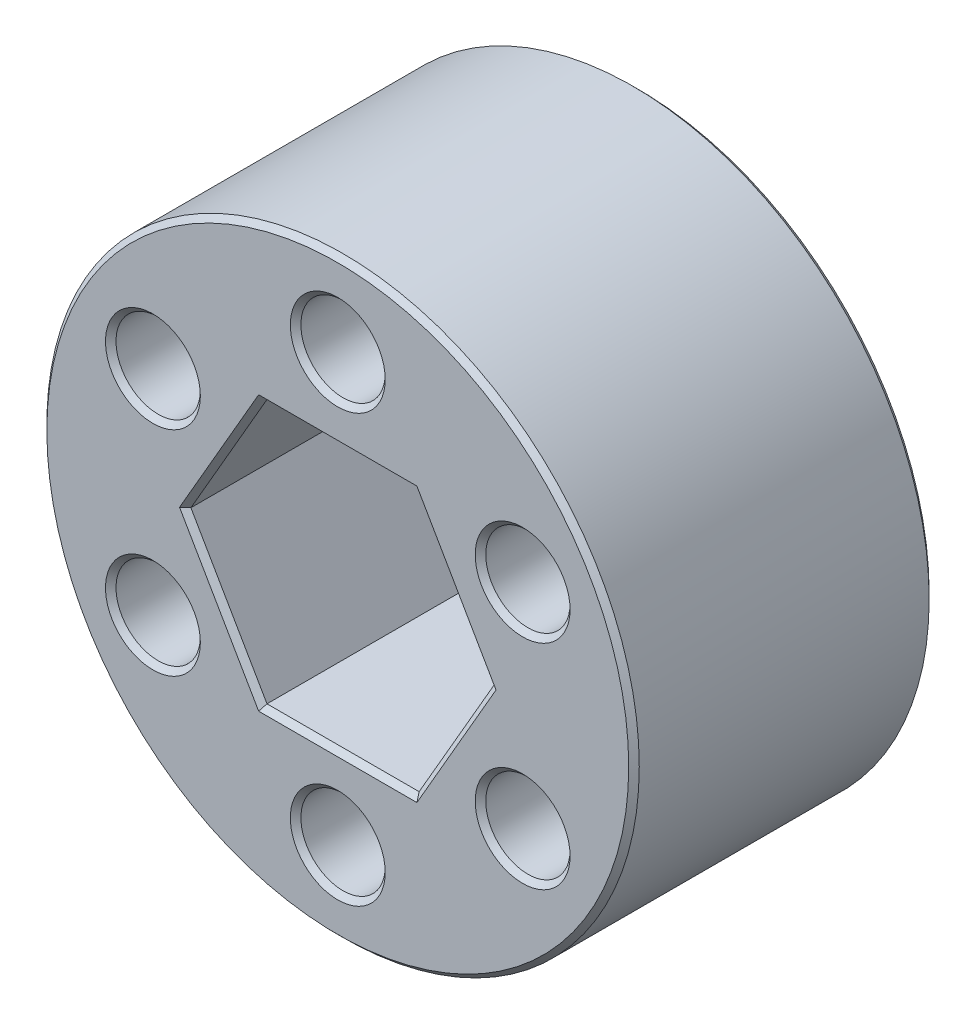
ISO-10303-21;
HEADER;
FILE_DESCRIPTION(('STEP AP214'),'2;1');
FILE_NAME('part.step','',(''),(''),'','','');
FILE_SCHEMA(('AUTOMOTIVE_DESIGN { 1 0 10303 214 1 1 1 1 }'));
ENDSEC;
DATA;
#1=APPLICATION_CONTEXT('core data for automotive mechanical design processes');
#2=APPLICATION_PROTOCOL_DEFINITION('international standard','automotive_design',2000,#1);
#3=PRODUCT_CONTEXT('',#1,'mechanical');
#4=PRODUCT('Part','Part','',(#3));
#5=PRODUCT_RELATED_PRODUCT_CATEGORY('part','',(#4));
#6=PRODUCT_DEFINITION_FORMATION('','',#4);
#7=PRODUCT_DEFINITION_CONTEXT('part definition',#1,'design');
#8=PRODUCT_DEFINITION('design','',#6,#7);
#9=PRODUCT_DEFINITION_SHAPE('','',#8);
#10=(LENGTH_UNIT() NAMED_UNIT(*) SI_UNIT(.MILLI.,.METRE.));
#11=(NAMED_UNIT(*) PLANE_ANGLE_UNIT() SI_UNIT($,.RADIAN.));
#12=(NAMED_UNIT(*) SI_UNIT($,.STERADIAN.) SOLID_ANGLE_UNIT());
#13=UNCERTAINTY_MEASURE_WITH_UNIT(LENGTH_MEASURE(1.E-05),#10,'distance_accuracy_value','');
#14=(GEOMETRIC_REPRESENTATION_CONTEXT(3) GLOBAL_UNCERTAINTY_ASSIGNED_CONTEXT((#13)) GLOBAL_UNIT_ASSIGNED_CONTEXT((#10,
#11,#12)) REPRESENTATION_CONTEXT('',''));
#15=CARTESIAN_POINT('',(0.,0.,0.));
#16=DIRECTION('',(0.,0.,1.));
#17=DIRECTION('',(1.,0.,0.));
#18=AXIS2_PLACEMENT_3D('',#15,#16,#17);
#19=CARTESIAN_POINT('',(0.,0.,14.478));
#20=DIRECTION('',(0.,0.,1.));
#21=DIRECTION('',(1.,0.,0.));
#22=AXIS2_PLACEMENT_3D('',#19,#20,#21);
#23=PLANE('',#22);
#24=CARTESIAN_POINT('',(-8.90880332873053,5.14349999999999,14.478));
#25=DIRECTION('',(0.,0.,1.));
#26=DIRECTION('',(1.,0.,0.));
#27=AXIS2_PLACEMENT_3D('',#24,#25,#26);
#28=CIRCLE('',#27,2.286);
#29=CARTESIAN_POINT('',(-6.62280332873052,5.14349999999999,14.478));
#30=VERTEX_POINT('',#29);
#31=EDGE_CURVE('E11',#30,#30,#28,.F.);
#32=ORIENTED_EDGE('',*,*,#31,.T.);
#33=EDGE_LOOP('',(#32));
#34=FACE_BOUND('',#33,.T.);
#35=CARTESIAN_POINT('',(0.,-10.287,14.478));
#36=DIRECTION('',(0.,0.,1.));
#37=DIRECTION('',(1.,0.,0.));
#38=AXIS2_PLACEMENT_3D('',#35,#36,#37);
#39=CIRCLE('',#38,2.286);
#40=CARTESIAN_POINT('',(2.286,-10.287,14.478));
#41=VERTEX_POINT('',#40);
#42=EDGE_CURVE('E42',#41,#41,#39,.F.);
#43=ORIENTED_EDGE('',*,*,#42,.T.);
#44=EDGE_LOOP('',(#43));
#45=FACE_BOUND('',#44,.T.);
#46=CARTESIAN_POINT('',(8.90880332873052,5.1435,14.478));
#47=DIRECTION('',(0.,0.,1.));
#48=DIRECTION('',(1.,0.,0.));
#49=AXIS2_PLACEMENT_3D('',#46,#47,#48);
#50=CIRCLE('',#49,2.286);
#51=CARTESIAN_POINT('',(11.1948033287305,5.1435,14.478));
#52=VERTEX_POINT('',#51);
#53=EDGE_CURVE('E262',#52,#52,#50,.F.);
#54=ORIENTED_EDGE('',*,*,#53,.T.);
#55=EDGE_LOOP('',(#54));
#56=FACE_BOUND('',#55,.T.);
#57=DIRECTION('',(-0.5,-0.866025403784439,0.));
#58=VECTOR('',#57,1.);
#59=CARTESIAN_POINT('',(5.71923176659244,-3.302,14.478));
#60=LINE('',#59,#58);
#61=CARTESIAN_POINT('',(7.62564235545659,0.,14.478));
#62=VERTEX_POINT('',#61);
#63=CARTESIAN_POINT('',(3.8128211777283,-6.60400000000001,14.478));
#64=VERTEX_POINT('',#63);
#65=EDGE_CURVE('E50',#62,#64,#60,.T.);
#66=ORIENTED_EDGE('',*,*,#65,.T.);
#67=DIRECTION('',(-1.,0.,0.));
#68=VECTOR('',#67,1.);
#69=CARTESIAN_POINT('',(0.,-6.60400000000001,14.478));
#70=LINE('',#69,#68);
#71=CARTESIAN_POINT('',(-3.81282117772829,-6.60400000000001,14.478));
#72=VERTEX_POINT('',#71);
#73=EDGE_CURVE('E260',#64,#72,#70,.T.);
#74=ORIENTED_EDGE('',*,*,#73,.T.);
#75=DIRECTION('',(-0.5,0.866025403784439,0.));
#76=VECTOR('',#75,1.);
#77=CARTESIAN_POINT('',(-5.71923176659244,-3.30200000000001,14.478));
#78=LINE('',#77,#76);
#79=CARTESIAN_POINT('',(-7.62564235545659,0.,14.478));
#80=VERTEX_POINT('',#79);
#81=EDGE_CURVE('E252',#72,#80,#78,.T.);
#82=ORIENTED_EDGE('',*,*,#81,.T.);
#83=DIRECTION('',(0.5,0.866025403784439,0.));
#84=VECTOR('',#83,1.);
#85=CARTESIAN_POINT('',(-5.71923176659244,3.302,14.478));
#86=LINE('',#85,#84);
#87=CARTESIAN_POINT('',(-3.81282117772829,6.60400000000001,14.478));
#88=VERTEX_POINT('',#87);
#89=EDGE_CURVE('E254',#80,#88,#86,.T.);
#90=ORIENTED_EDGE('',*,*,#89,.T.);
#91=DIRECTION('',(1.,0.,0.));
#92=VECTOR('',#91,1.);
#93=CARTESIAN_POINT('',(0.,6.60400000000001,14.478));
#94=LINE('',#93,#92);
#95=CARTESIAN_POINT('',(3.81282117772829,6.60400000000001,14.478));
#96=VERTEX_POINT('',#95);
#97=EDGE_CURVE('E256',#88,#96,#94,.T.);
#98=ORIENTED_EDGE('',*,*,#97,.T.);
#99=DIRECTION('',(0.5,-0.866025403784439,0.));
#100=VECTOR('',#99,1.);
#101=CARTESIAN_POINT('',(5.71923176659244,3.30200000000001,14.478));
#102=LINE('',#101,#100);
#103=EDGE_CURVE('E55',#96,#62,#102,.T.);
#104=ORIENTED_EDGE('',*,*,#103,.T.);
#105=EDGE_LOOP('',(#66,#74,#82,#90,#98,#104));
#106=FACE_BOUND('',#105,.T.);
#107=CARTESIAN_POINT('',(0.,0.,14.478));
#108=DIRECTION('',(0.,0.,1.));
#109=DIRECTION('',(1.,0.,0.));
#110=AXIS2_PLACEMENT_3D('',#107,#108,#109);
#111=CIRCLE('',#110,14.0208);
#112=CARTESIAN_POINT('',(14.0208,0.,14.478));
#113=VERTEX_POINT('',#112);
#114=EDGE_CURVE('E249',#113,#113,#111,.T.);
#115=ORIENTED_EDGE('',*,*,#114,.T.);
#116=EDGE_LOOP('',(#115));
#117=FACE_BOUND('',#116,.T.);
#118=CARTESIAN_POINT('',(0.,10.287,14.478));
#119=DIRECTION('',(0.,0.,1.));
#120=DIRECTION('',(1.,0.,0.));
#121=AXIS2_PLACEMENT_3D('',#118,#119,#120);
#122=CIRCLE('',#121,2.286);
#123=CARTESIAN_POINT('',(2.286,10.287,14.478));
#124=VERTEX_POINT('',#123);
#125=EDGE_CURVE('E246',#124,#124,#122,.F.);
#126=ORIENTED_EDGE('',*,*,#125,.T.);
#127=EDGE_LOOP('',(#126));
#128=FACE_BOUND('',#127,.T.);
#129=CARTESIAN_POINT('',(8.90880332873052,-5.1435,14.478));
#130=DIRECTION('',(0.,0.,1.));
#131=DIRECTION('',(1.,0.,0.));
#132=AXIS2_PLACEMENT_3D('',#129,#130,#131);
#133=CIRCLE('',#132,2.286);
#134=CARTESIAN_POINT('',(11.1948033287305,-5.1435,14.478));
#135=VERTEX_POINT('',#134);
#136=EDGE_CURVE('E243',#135,#135,#133,.F.);
#137=ORIENTED_EDGE('',*,*,#136,.T.);
#138=EDGE_LOOP('',(#137));
#139=FACE_BOUND('',#138,.T.);
#140=CARTESIAN_POINT('',(-8.90880332873052,-5.14350000000001,14.478));
#141=DIRECTION('',(0.,0.,1.));
#142=DIRECTION('',(1.,0.,0.));
#143=AXIS2_PLACEMENT_3D('',#140,#141,#142);
#144=CIRCLE('',#143,2.286);
#145=CARTESIAN_POINT('',(-6.62280332873052,-5.14350000000001,14.478));
#146=VERTEX_POINT('',#145);
#147=EDGE_CURVE('E240',#146,#146,#144,.F.);
#148=ORIENTED_EDGE('',*,*,#147,.T.);
#149=EDGE_LOOP('',(#148));
#150=FACE_BOUND('',#149,.T.);
#151=ADVANCED_FACE('F33',(#34,#45,#56,#106,#117,#128,#139,#150),#23,.T.);
#152=CARTESIAN_POINT('',(0.,0.,0.));
#153=DIRECTION('',(0.,0.,1.));
#154=DIRECTION('',(1.,0.,0.));
#155=AXIS2_PLACEMENT_3D('',#152,#153,#154);
#156=PLANE('',#155);
#157=CARTESIAN_POINT('',(-8.90880332873053,5.14349999999999,0.));
#158=DIRECTION('',(0.,0.,1.));
#159=DIRECTION('',(1.,0.,0.));
#160=AXIS2_PLACEMENT_3D('',#157,#158,#159);
#161=CIRCLE('',#160,2.286);
#162=CARTESIAN_POINT('',(-6.62280332873053,5.14349999999999,0.));
#163=VERTEX_POINT('',#162);
#164=EDGE_CURVE('E171',#163,#163,#161,.T.);
#165=ORIENTED_EDGE('',*,*,#164,.T.);
#166=EDGE_LOOP('',(#165));
#167=FACE_BOUND('',#166,.T.);
#168=CARTESIAN_POINT('',(-8.90880332873052,-5.14350000000001,0.));
#169=DIRECTION('',(0.,0.,1.));
#170=DIRECTION('',(1.,0.,0.));
#171=AXIS2_PLACEMENT_3D('',#168,#169,#170);
#172=CIRCLE('',#171,2.286);
#173=CARTESIAN_POINT('',(-6.62280332873052,-5.14350000000001,0.));
#174=VERTEX_POINT('',#173);
#175=EDGE_CURVE('E168',#174,#174,#172,.T.);
#176=ORIENTED_EDGE('',*,*,#175,.T.);
#177=EDGE_LOOP('',(#176));
#178=FACE_BOUND('',#177,.T.);
#179=CARTESIAN_POINT('',(0.,-10.287,0.));
#180=DIRECTION('',(0.,0.,1.));
#181=DIRECTION('',(1.,0.,0.));
#182=AXIS2_PLACEMENT_3D('',#179,#180,#181);
#183=CIRCLE('',#182,2.286);
#184=CARTESIAN_POINT('',(2.286,-10.287,0.));
#185=VERTEX_POINT('',#184);
#186=EDGE_CURVE('E165',#185,#185,#183,.T.);
#187=ORIENTED_EDGE('',*,*,#186,.T.);
#188=EDGE_LOOP('',(#187));
#189=FACE_BOUND('',#188,.T.);
#190=CARTESIAN_POINT('',(8.90880332873052,-5.1435,0.));
#191=DIRECTION('',(0.,0.,1.));
#192=DIRECTION('',(1.,0.,0.));
#193=AXIS2_PLACEMENT_3D('',#190,#191,#192);
#194=CIRCLE('',#193,2.286);
#195=CARTESIAN_POINT('',(11.1948033287305,-5.1435,0.));
#196=VERTEX_POINT('',#195);
#197=EDGE_CURVE('E162',#196,#196,#194,.T.);
#198=ORIENTED_EDGE('',*,*,#197,.T.);
#199=EDGE_LOOP('',(#198));
#200=FACE_BOUND('',#199,.T.);
#201=CARTESIAN_POINT('',(8.90880332873052,5.1435,0.));
#202=DIRECTION('',(0.,0.,1.));
#203=DIRECTION('',(1.,0.,0.));
#204=AXIS2_PLACEMENT_3D('',#201,#202,#203);
#205=CIRCLE('',#204,2.286);
#206=CARTESIAN_POINT('',(11.1948033287305,5.1435,0.));
#207=VERTEX_POINT('',#206);
#208=EDGE_CURVE('E154',#207,#207,#205,.T.);
#209=ORIENTED_EDGE('',*,*,#208,.T.);
#210=EDGE_LOOP('',(#209));
#211=FACE_BOUND('',#210,.T.);
#212=CARTESIAN_POINT('',(0.,10.287,0.));
#213=DIRECTION('',(0.,0.,1.));
#214=DIRECTION('',(1.,0.,0.));
#215=AXIS2_PLACEMENT_3D('',#212,#213,#214);
#216=CIRCLE('',#215,2.286);
#217=CARTESIAN_POINT('',(2.286,10.287,0.));
#218=VERTEX_POINT('',#217);
#219=EDGE_CURVE('E151',#218,#218,#216,.T.);
#220=ORIENTED_EDGE('',*,*,#219,.T.);
#221=EDGE_LOOP('',(#220));
#222=FACE_BOUND('',#221,.T.);
#223=DIRECTION('',(-0.5,0.866025403784439,0.));
#224=VECTOR('',#223,1.);
#225=CARTESIAN_POINT('',(3.88614466191536,6.477,0.));
#226=LINE('',#225,#224);
#227=CARTESIAN_POINT('',(7.62564235545657,0.,0.));
#228=VERTEX_POINT('',#227);
#229=CARTESIAN_POINT('',(3.81282117772828,6.60399999999999,0.));
#230=VERTEX_POINT('',#229);
#231=EDGE_CURVE('E149',#228,#230,#226,.T.);
#232=ORIENTED_EDGE('',*,*,#231,.T.);
#233=DIRECTION('',(-1.,0.,0.));
#234=VECTOR('',#233,1.);
#235=CARTESIAN_POINT('',(-3.66617420935412,6.60399999999999,0.));
#236=LINE('',#235,#234);
#237=CARTESIAN_POINT('',(-3.81282117772828,6.60399999999999,0.));
#238=VERTEX_POINT('',#237);
#239=EDGE_CURVE('E129',#230,#238,#236,.T.);
#240=ORIENTED_EDGE('',*,*,#239,.T.);
#241=DIRECTION('',(-0.5,-0.866025403784439,0.));
#242=VECTOR('',#241,1.);
#243=CARTESIAN_POINT('',(-7.55231887126949,0.126999999999992,0.));
#244=LINE('',#243,#242);
#245=CARTESIAN_POINT('',(-7.62564235545657,0.,0.));
#246=VERTEX_POINT('',#245);
#247=EDGE_CURVE('E137',#238,#246,#244,.T.);
#248=ORIENTED_EDGE('',*,*,#247,.T.);
#249=DIRECTION('',(0.5,-0.866025403784439,0.));
#250=VECTOR('',#249,1.);
#251=CARTESIAN_POINT('',(-3.88614466191536,-6.477,0.));
#252=LINE('',#251,#250);
#253=CARTESIAN_POINT('',(-3.81282117772828,-6.60399999999999,0.));
#254=VERTEX_POINT('',#253);
#255=EDGE_CURVE('E143',#246,#254,#252,.T.);
#256=ORIENTED_EDGE('',*,*,#255,.T.);
#257=DIRECTION('',(1.,0.,0.));
#258=VECTOR('',#257,1.);
#259=CARTESIAN_POINT('',(3.66617420935413,-6.60399999999999,0.));
#260=LINE('',#259,#258);
#261=CARTESIAN_POINT('',(3.81282117772829,-6.60399999999999,0.));
#262=VERTEX_POINT('',#261);
#263=EDGE_CURVE('E335',#254,#262,#260,.T.);
#264=ORIENTED_EDGE('',*,*,#263,.T.);
#265=DIRECTION('',(0.5,0.866025403784439,0.));
#266=VECTOR('',#265,1.);
#267=CARTESIAN_POINT('',(7.55231887126949,-0.126999999999993,0.));
#268=LINE('',#267,#266);
#269=EDGE_CURVE('E156',#262,#228,#268,.T.);
#270=ORIENTED_EDGE('',*,*,#269,.T.);
#271=EDGE_LOOP('',(#232,#240,#248,#256,#264,#270));
#272=FACE_BOUND('',#271,.T.);
#273=CARTESIAN_POINT('',(0.,0.,0.));
#274=DIRECTION('',(0.,0.,1.));
#275=DIRECTION('',(1.,0.,0.));
#276=AXIS2_PLACEMENT_3D('',#273,#274,#275);
#277=CIRCLE('',#276,14.0208);
#278=CARTESIAN_POINT('',(14.0208,0.,0.));
#279=VERTEX_POINT('',#278);
#280=EDGE_CURVE('E144',#279,#279,#277,.F.);
#281=ORIENTED_EDGE('',*,*,#280,.T.);
#282=EDGE_LOOP('',(#281));
#283=FACE_BOUND('',#282,.T.);
#284=ADVANCED_FACE('F146',(#167,#178,#189,#200,#211,#222,#272,#283),#156,.F.);
#285=CARTESIAN_POINT('',(0.,0.,14.478));
#286=DIRECTION('',(0.,0.,-1.));
#287=DIRECTION('',(-1.,0.,0.));
#288=AXIS2_PLACEMENT_3D('',#285,#286,#287);
#289=CYLINDRICAL_SURFACE('',#288,14.2748);
#290=CARTESIAN_POINT('',(0.,0.,0.253999999999999));
#291=DIRECTION('',(0.,0.,1.));
#292=DIRECTION('',(1.,0.,0.));
#293=AXIS2_PLACEMENT_3D('',#290,#291,#292);
#294=CIRCLE('',#293,14.2748);
#295=CARTESIAN_POINT('',(14.2748,0.,0.253999999999999));
#296=VERTEX_POINT('',#295);
#297=EDGE_CURVE('E237',#296,#296,#294,.T.);
#298=ORIENTED_EDGE('',*,*,#297,.T.);
#299=EDGE_LOOP('',(#298));
#300=FACE_BOUND('',#299,.T.);
#301=CARTESIAN_POINT('',(0.,0.,14.224));
#302=DIRECTION('',(0.,0.,1.));
#303=DIRECTION('',(1.,0.,0.));
#304=AXIS2_PLACEMENT_3D('',#301,#302,#303);
#305=CIRCLE('',#304,14.2748);
#306=CARTESIAN_POINT('',(14.2748,0.,14.224));
#307=VERTEX_POINT('',#306);
#308=EDGE_CURVE('E234',#307,#307,#305,.F.);
#309=ORIENTED_EDGE('',*,*,#308,.T.);
#310=EDGE_LOOP('',(#309));
#311=FACE_BOUND('',#310,.T.);
#312=ADVANCED_FACE('F386',(#300,#311),#289,.T.);
#313=CARTESIAN_POINT('',(-3.66617420935412,6.35,14.478));
#314=DIRECTION('',(0.866025403784439,-0.5,0.));
#315=DIRECTION('',(0.5,0.866025403784439,0.));
#316=AXIS2_PLACEMENT_3D('',#313,#314,#315);
#317=PLANE('',#316);
#318=DIRECTION('',(0.,0.,-1.));
#319=VECTOR('',#318,1.);
#320=CARTESIAN_POINT('',(-7.33234841870825,0.,14.478));
#321=LINE('',#320,#319);
#322=CARTESIAN_POINT('',(-7.33234841870825,0.,14.224));
#323=VERTEX_POINT('',#322);
#324=CARTESIAN_POINT('',(-7.33234841870825,0.,0.25399999999999));
#325=VERTEX_POINT('',#324);
#326=EDGE_CURVE('E319',#323,#325,#321,.T.);
#327=ORIENTED_EDGE('',*,*,#326,.T.);
#328=DIRECTION('',(0.5,0.866025403784439,0.));
#329=VECTOR('',#328,1.);
#330=CARTESIAN_POINT('',(-3.66617420935412,6.35,0.25399999999999));
#331=LINE('',#330,#329);
#332=CARTESIAN_POINT('',(-3.66617420935412,6.35,0.25399999999999));
#333=VERTEX_POINT('',#332);
#334=EDGE_CURVE('E232',#325,#333,#331,.T.);
#335=ORIENTED_EDGE('',*,*,#334,.T.);
#336=DIRECTION('',(0.,0.,-1.));
#337=VECTOR('',#336,1.);
#338=CARTESIAN_POINT('',(-3.66617420935412,6.35,14.478));
#339=LINE('',#338,#337);
#340=CARTESIAN_POINT('',(-3.66617420935412,6.35,14.224));
#341=VERTEX_POINT('',#340);
#342=EDGE_CURVE('E278',#341,#333,#339,.T.);
#343=ORIENTED_EDGE('',*,*,#342,.F.);
#344=DIRECTION('',(-0.5,-0.866025403784439,0.));
#345=VECTOR('',#344,1.);
#346=CARTESIAN_POINT('',(-3.66617420935412,6.35,14.224));
#347=LINE('',#346,#345);
#348=EDGE_CURVE('E230',#341,#323,#347,.T.);
#349=ORIENTED_EDGE('',*,*,#348,.T.);
#350=EDGE_LOOP('',(#327,#335,#343,#349));
#351=FACE_BOUND('',#350,.T.);
#352=ADVANCED_FACE('F391',(#351),#317,.T.);
#353=CARTESIAN_POINT('',(-7.33234841870825,0.,14.478));
#354=DIRECTION('',(0.866025403784439,0.5,0.));
#355=DIRECTION('',(-0.5,0.866025403784439,0.));
#356=AXIS2_PLACEMENT_3D('',#353,#354,#355);
#357=PLANE('',#356);
#358=DIRECTION('',(0.,0.,-1.));
#359=VECTOR('',#358,1.);
#360=CARTESIAN_POINT('',(-3.66617420935412,-6.35,14.478));
#361=LINE('',#360,#359);
#362=CARTESIAN_POINT('',(-3.66617420935412,-6.35,14.224));
#363=VERTEX_POINT('',#362);
#364=CARTESIAN_POINT('',(-3.66617420935412,-6.35,0.25399999999999));
#365=VERTEX_POINT('',#364);
#366=EDGE_CURVE('E316',#363,#365,#361,.T.);
#367=ORIENTED_EDGE('',*,*,#366,.T.);
#368=DIRECTION('',(-0.5,0.866025403784439,0.));
#369=VECTOR('',#368,1.);
#370=CARTESIAN_POINT('',(-7.33234841870825,0.,0.25399999999999));
#371=LINE('',#370,#369);
#372=EDGE_CURVE('E228',#365,#325,#371,.T.);
#373=ORIENTED_EDGE('',*,*,#372,.T.);
#374=ORIENTED_EDGE('',*,*,#326,.F.);
#375=DIRECTION('',(0.5,-0.866025403784439,0.));
#376=VECTOR('',#375,1.);
#377=CARTESIAN_POINT('',(-7.33234841870825,0.,14.224));
#378=LINE('',#377,#376);
#379=EDGE_CURVE('E226',#323,#363,#378,.T.);
#380=ORIENTED_EDGE('',*,*,#379,.T.);
#381=EDGE_LOOP('',(#367,#373,#374,#380));
#382=FACE_BOUND('',#381,.T.);
#383=ADVANCED_FACE('F315',(#382),#357,.T.);
#384=CARTESIAN_POINT('',(-3.66617420935412,-6.35,14.478));
#385=DIRECTION('',(0.,1.,0.));
#386=DIRECTION('',(-1.,0.,0.));
#387=AXIS2_PLACEMENT_3D('',#384,#385,#386);
#388=PLANE('',#387);
#389=DIRECTION('',(0.,0.,-1.));
#390=VECTOR('',#389,1.);
#391=CARTESIAN_POINT('',(3.66617420935413,-6.35,14.478));
#392=LINE('',#391,#390);
#393=CARTESIAN_POINT('',(3.66617420935413,-6.35,14.224));
#394=VERTEX_POINT('',#393);
#395=CARTESIAN_POINT('',(3.66617420935413,-6.35,0.25399999999999));
#396=VERTEX_POINT('',#395);
#397=EDGE_CURVE('E325',#394,#396,#392,.T.);
#398=ORIENTED_EDGE('',*,*,#397,.T.);
#399=DIRECTION('',(-1.,0.,0.));
#400=VECTOR('',#399,1.);
#401=CARTESIAN_POINT('',(-3.66617420935412,-6.35,0.25399999999999));
#402=LINE('',#401,#400);
#403=EDGE_CURVE('E224',#396,#365,#402,.T.);
#404=ORIENTED_EDGE('',*,*,#403,.T.);
#405=ORIENTED_EDGE('',*,*,#366,.F.);
#406=DIRECTION('',(1.,0.,0.));
#407=VECTOR('',#406,1.);
#408=CARTESIAN_POINT('',(-3.66617420935412,-6.35,14.224));
#409=LINE('',#408,#407);
#410=EDGE_CURVE('E221',#363,#394,#409,.T.);
#411=ORIENTED_EDGE('',*,*,#410,.T.);
#412=EDGE_LOOP('',(#398,#404,#405,#411));
#413=FACE_BOUND('',#412,.T.);
#414=ADVANCED_FACE('F322',(#413),#388,.T.);
#415=CARTESIAN_POINT('',(3.66617420935413,-6.35,14.478));
#416=DIRECTION('',(-0.866025403784439,0.5,0.));
#417=DIRECTION('',(-0.5,-0.866025403784439,0.));
#418=AXIS2_PLACEMENT_3D('',#415,#416,#417);
#419=PLANE('',#418);
#420=DIRECTION('',(0.,0.,-1.));
#421=VECTOR('',#420,1.);
#422=CARTESIAN_POINT('',(7.33234841870825,0.,14.478));
#423=LINE('',#422,#421);
#424=CARTESIAN_POINT('',(7.33234841870825,0.,14.224));
#425=VERTEX_POINT('',#424);
#426=CARTESIAN_POINT('',(7.33234841870825,0.,0.25399999999999));
#427=VERTEX_POINT('',#426);
#428=EDGE_CURVE('E328',#425,#427,#423,.T.);
#429=ORIENTED_EDGE('',*,*,#428,.T.);
#430=DIRECTION('',(-0.5,-0.866025403784439,0.));
#431=VECTOR('',#430,1.);
#432=CARTESIAN_POINT('',(3.66617420935413,-6.35,0.25399999999999));
#433=LINE('',#432,#431);
#434=EDGE_CURVE('E219',#427,#396,#433,.T.);
#435=ORIENTED_EDGE('',*,*,#434,.T.);
#436=ORIENTED_EDGE('',*,*,#397,.F.);
#437=DIRECTION('',(0.5,0.866025403784439,0.));
#438=VECTOR('',#437,1.);
#439=CARTESIAN_POINT('',(3.66617420935413,-6.35,14.224));
#440=LINE('',#439,#438);
#441=EDGE_CURVE('E217',#394,#425,#440,.T.);
#442=ORIENTED_EDGE('',*,*,#441,.T.);
#443=EDGE_LOOP('',(#429,#435,#436,#442));
#444=FACE_BOUND('',#443,.T.);
#445=ADVANCED_FACE('F360',(#444),#419,.T.);
#446=CARTESIAN_POINT('',(7.33234841870825,0.,14.478));
#447=DIRECTION('',(-0.866025403784438,-0.5,0.));
#448=DIRECTION('',(0.5,-0.866025403784439,0.));
#449=AXIS2_PLACEMENT_3D('',#446,#447,#448);
#450=PLANE('',#449);
#451=DIRECTION('',(0.,0.,-1.));
#452=VECTOR('',#451,1.);
#453=CARTESIAN_POINT('',(3.66617420935412,6.35,14.478));
#454=LINE('',#453,#452);
#455=CARTESIAN_POINT('',(3.66617420935412,6.35,14.224));
#456=VERTEX_POINT('',#455);
#457=CARTESIAN_POINT('',(3.66617420935412,6.35,0.25399999999999));
#458=VERTEX_POINT('',#457);
#459=EDGE_CURVE('E354',#456,#458,#454,.T.);
#460=ORIENTED_EDGE('',*,*,#459,.T.);
#461=DIRECTION('',(0.5,-0.866025403784439,0.));
#462=VECTOR('',#461,1.);
#463=CARTESIAN_POINT('',(7.33234841870825,0.,0.253999999999991));
#464=LINE('',#463,#462);
#465=EDGE_CURVE('E215',#458,#427,#464,.T.);
#466=ORIENTED_EDGE('',*,*,#465,.T.);
#467=ORIENTED_EDGE('',*,*,#428,.F.);
#468=DIRECTION('',(-0.5,0.866025403784439,0.));
#469=VECTOR('',#468,1.);
#470=CARTESIAN_POINT('',(7.33234841870825,0.,14.224));
#471=LINE('',#470,#469);
#472=EDGE_CURVE('E213',#425,#456,#471,.T.);
#473=ORIENTED_EDGE('',*,*,#472,.T.);
#474=EDGE_LOOP('',(#460,#466,#467,#473));
#475=FACE_BOUND('',#474,.T.);
#476=ADVANCED_FACE('F356',(#475),#450,.T.);
#477=CARTESIAN_POINT('',(3.66617420935412,6.35,14.478));
#478=DIRECTION('',(0.,-1.,0.));
#479=DIRECTION('',(0.,0.,-1.));
#480=AXIS2_PLACEMENT_3D('',#477,#478,#479);
#481=PLANE('',#480);
#482=ORIENTED_EDGE('',*,*,#342,.T.);
#483=DIRECTION('',(1.,0.,0.));
#484=VECTOR('',#483,1.);
#485=CARTESIAN_POINT('',(3.66617420935412,6.35,0.25399999999999));
#486=LINE('',#485,#484);
#487=EDGE_CURVE('E131',#333,#458,#486,.T.);
#488=ORIENTED_EDGE('',*,*,#487,.T.);
#489=ORIENTED_EDGE('',*,*,#459,.F.);
#490=DIRECTION('',(-1.,0.,0.));
#491=VECTOR('',#490,1.);
#492=CARTESIAN_POINT('',(3.66617420935412,6.35,14.224));
#493=LINE('',#492,#491);
#494=EDGE_CURVE('E210',#456,#341,#493,.T.);
#495=ORIENTED_EDGE('',*,*,#494,.T.);
#496=EDGE_LOOP('',(#482,#488,#489,#495));
#497=FACE_BOUND('',#496,.T.);
#498=ADVANCED_FACE('F353',(#497),#481,.T.);
#499=CARTESIAN_POINT('',(0.,10.287,14.478));
#500=DIRECTION('',(0.,0.,-1.));
#501=DIRECTION('',(-1.,0.,0.));
#502=AXIS2_PLACEMENT_3D('',#499,#500,#501);
#503=CYLINDRICAL_SURFACE('',#502,2.032);
#504=CARTESIAN_POINT('',(0.,10.287,0.254000000000001));
#505=DIRECTION('',(0.,0.,1.));
#506=DIRECTION('',(1.,0.,0.));
#507=AXIS2_PLACEMENT_3D('',#504,#505,#506);
#508=CIRCLE('',#507,2.032);
#509=CARTESIAN_POINT('',(2.032,10.287,0.254000000000001));
#510=VERTEX_POINT('',#509);
#511=EDGE_CURVE('E207',#510,#510,#508,.F.);
#512=ORIENTED_EDGE('',*,*,#511,.T.);
#513=EDGE_LOOP('',(#512));
#514=FACE_BOUND('',#513,.T.);
#515=CARTESIAN_POINT('',(0.,10.287,14.224));
#516=DIRECTION('',(0.,0.,1.));
#517=DIRECTION('',(1.,0.,0.));
#518=AXIS2_PLACEMENT_3D('',#515,#516,#517);
#519=CIRCLE('',#518,2.032);
#520=CARTESIAN_POINT('',(2.032,10.287,14.224));
#521=VERTEX_POINT('',#520);
#522=EDGE_CURVE('E204',#521,#521,#519,.T.);
#523=ORIENTED_EDGE('',*,*,#522,.T.);
#524=EDGE_LOOP('',(#523));
#525=FACE_BOUND('',#524,.T.);
#526=ADVANCED_FACE('F463',(#514,#525),#503,.F.);
#527=CARTESIAN_POINT('',(8.90880332873052,5.1435,14.478));
#528=DIRECTION('',(0.,0.,-1.));
#529=DIRECTION('',(-1.,0.,0.));
#530=AXIS2_PLACEMENT_3D('',#527,#528,#529);
#531=CYLINDRICAL_SURFACE('',#530,2.032);
#532=CARTESIAN_POINT('',(8.90880332873052,5.1435,0.254000000000001));
#533=DIRECTION('',(0.,0.,1.));
#534=DIRECTION('',(1.,0.,0.));
#535=AXIS2_PLACEMENT_3D('',#532,#533,#534);
#536=CIRCLE('',#535,2.032);
#537=CARTESIAN_POINT('',(10.9408033287305,5.1435,0.254000000000001));
#538=VERTEX_POINT('',#537);
#539=EDGE_CURVE('E201',#538,#538,#536,.F.);
#540=ORIENTED_EDGE('',*,*,#539,.T.);
#541=EDGE_LOOP('',(#540));
#542=FACE_BOUND('',#541,.T.);
#543=CARTESIAN_POINT('',(8.90880332873052,5.1435,14.224));
#544=DIRECTION('',(0.,0.,1.));
#545=DIRECTION('',(1.,0.,0.));
#546=AXIS2_PLACEMENT_3D('',#543,#544,#545);
#547=CIRCLE('',#546,2.032);
#548=CARTESIAN_POINT('',(10.9408033287305,5.1435,14.224));
#549=VERTEX_POINT('',#548);
#550=EDGE_CURVE('E198',#549,#549,#547,.T.);
#551=ORIENTED_EDGE('',*,*,#550,.T.);
#552=EDGE_LOOP('',(#551));
#553=FACE_BOUND('',#552,.T.);
#554=ADVANCED_FACE('F460',(#542,#553),#531,.F.);
#555=CARTESIAN_POINT('',(8.90880332873052,-5.1435,14.478));
#556=DIRECTION('',(0.,0.,-1.));
#557=DIRECTION('',(-1.,0.,0.));
#558=AXIS2_PLACEMENT_3D('',#555,#556,#557);
#559=CYLINDRICAL_SURFACE('',#558,2.032);
#560=CARTESIAN_POINT('',(8.90880332873052,-5.1435,0.253999999999999));
#561=DIRECTION('',(0.,0.,1.));
#562=DIRECTION('',(1.,0.,0.));
#563=AXIS2_PLACEMENT_3D('',#560,#561,#562);
#564=CIRCLE('',#563,2.032);
#565=CARTESIAN_POINT('',(10.9408033287305,-5.1435,0.253999999999999));
#566=VERTEX_POINT('',#565);
#567=EDGE_CURVE('E195',#566,#566,#564,.F.);
#568=ORIENTED_EDGE('',*,*,#567,.T.);
#569=EDGE_LOOP('',(#568));
#570=FACE_BOUND('',#569,.T.);
#571=CARTESIAN_POINT('',(8.90880332873052,-5.1435,14.224));
#572=DIRECTION('',(0.,0.,1.));
#573=DIRECTION('',(1.,0.,0.));
#574=AXIS2_PLACEMENT_3D('',#571,#572,#573);
#575=CIRCLE('',#574,2.032);
#576=CARTESIAN_POINT('',(10.9408033287305,-5.1435,14.224));
#577=VERTEX_POINT('',#576);
#578=EDGE_CURVE('E192',#577,#577,#575,.T.);
#579=ORIENTED_EDGE('',*,*,#578,.T.);
#580=EDGE_LOOP('',(#579));
#581=FACE_BOUND('',#580,.T.);
#582=ADVANCED_FACE('F462',(#570,#581),#559,.F.);
#583=CARTESIAN_POINT('',(0.,-10.287,14.478));
#584=DIRECTION('',(0.,0.,-1.));
#585=DIRECTION('',(-1.,0.,0.));
#586=AXIS2_PLACEMENT_3D('',#583,#584,#585);
#587=CYLINDRICAL_SURFACE('',#586,2.032);
#588=CARTESIAN_POINT('',(0.,-10.287,0.253999999999999));
#589=DIRECTION('',(0.,0.,1.));
#590=DIRECTION('',(1.,0.,0.));
#591=AXIS2_PLACEMENT_3D('',#588,#589,#590);
#592=CIRCLE('',#591,2.032);
#593=CARTESIAN_POINT('',(2.032,-10.287,0.253999999999999));
#594=VERTEX_POINT('',#593);
#595=EDGE_CURVE('E189',#594,#594,#592,.F.);
#596=ORIENTED_EDGE('',*,*,#595,.T.);
#597=EDGE_LOOP('',(#596));
#598=FACE_BOUND('',#597,.T.);
#599=CARTESIAN_POINT('',(0.,-10.287,14.224));
#600=DIRECTION('',(0.,0.,1.));
#601=DIRECTION('',(1.,0.,0.));
#602=AXIS2_PLACEMENT_3D('',#599,#600,#601);
#603=CIRCLE('',#602,2.032);
#604=CARTESIAN_POINT('',(2.032,-10.287,14.224));
#605=VERTEX_POINT('',#604);
#606=EDGE_CURVE('E186',#605,#605,#603,.T.);
#607=ORIENTED_EDGE('',*,*,#606,.T.);
#608=EDGE_LOOP('',(#607));
#609=FACE_BOUND('',#608,.T.);
#610=ADVANCED_FACE('F470',(#598,#609),#587,.F.);
#611=CARTESIAN_POINT('',(-8.90880332873052,-5.14350000000001,14.478));
#612=DIRECTION('',(0.,0.,-1.));
#613=DIRECTION('',(-1.,0.,0.));
#614=AXIS2_PLACEMENT_3D('',#611,#612,#613);
#615=CYLINDRICAL_SURFACE('',#614,2.032);
#616=CARTESIAN_POINT('',(-8.90880332873052,-5.14350000000001,0.254000000000003));
#617=DIRECTION('',(0.,0.,1.));
#618=DIRECTION('',(1.,0.,0.));
#619=AXIS2_PLACEMENT_3D('',#616,#617,#618);
#620=CIRCLE('',#619,2.032);
#621=CARTESIAN_POINT('',(-6.87680332873052,-5.14350000000001,0.254000000000003));
#622=VERTEX_POINT('',#621);
#623=EDGE_CURVE('E183',#622,#622,#620,.F.);
#624=ORIENTED_EDGE('',*,*,#623,.T.);
#625=EDGE_LOOP('',(#624));
#626=FACE_BOUND('',#625,.T.);
#627=CARTESIAN_POINT('',(-8.90880332873052,-5.14350000000001,14.224));
#628=DIRECTION('',(0.,0.,1.));
#629=DIRECTION('',(1.,0.,0.));
#630=AXIS2_PLACEMENT_3D('',#627,#628,#629);
#631=CIRCLE('',#630,2.032);
#632=CARTESIAN_POINT('',(-6.87680332873052,-5.14350000000001,14.224));
#633=VERTEX_POINT('',#632);
#634=EDGE_CURVE('E180',#633,#633,#631,.T.);
#635=ORIENTED_EDGE('',*,*,#634,.T.);
#636=EDGE_LOOP('',(#635));
#637=FACE_BOUND('',#636,.T.);
#638=ADVANCED_FACE('F556',(#626,#637),#615,.F.);
#639=CARTESIAN_POINT('',(-8.90880332873053,5.14349999999999,14.478));
#640=DIRECTION('',(0.,0.,-1.));
#641=DIRECTION('',(-1.,0.,0.));
#642=AXIS2_PLACEMENT_3D('',#639,#640,#641);
#643=CYLINDRICAL_SURFACE('',#642,2.032);
#644=CARTESIAN_POINT('',(-8.90880332873053,5.14349999999999,0.254000000000003));
#645=DIRECTION('',(0.,0.,1.));
#646=DIRECTION('',(1.,0.,0.));
#647=AXIS2_PLACEMENT_3D('',#644,#645,#646);
#648=CIRCLE('',#647,2.032);
#649=CARTESIAN_POINT('',(-6.87680332873052,5.14349999999999,0.254000000000003));
#650=VERTEX_POINT('',#649);
#651=EDGE_CURVE('E177',#650,#650,#648,.F.);
#652=ORIENTED_EDGE('',*,*,#651,.T.);
#653=EDGE_LOOP('',(#652));
#654=FACE_BOUND('',#653,.T.);
#655=CARTESIAN_POINT('',(-8.90880332873053,5.14349999999999,14.224));
#656=DIRECTION('',(0.,0.,1.));
#657=DIRECTION('',(1.,0.,0.));
#658=AXIS2_PLACEMENT_3D('',#655,#656,#657);
#659=CIRCLE('',#658,2.032);
#660=CARTESIAN_POINT('',(-6.87680332873052,5.14349999999999,14.224));
#661=VERTEX_POINT('',#660);
#662=EDGE_CURVE('E174',#661,#661,#659,.T.);
#663=ORIENTED_EDGE('',*,*,#662,.T.);
#664=EDGE_LOOP('',(#663));
#665=FACE_BOUND('',#664,.T.);
#666=ADVANCED_FACE('F401',(#654,#665),#643,.F.);
#667=CARTESIAN_POINT('',(-8.90880332873053,5.14349999999999,0.));
#668=DIRECTION('',(0.,0.,-1.));
#669=DIRECTION('',(-1.,0.,0.));
#670=AXIS2_PLACEMENT_3D('',#667,#668,#669);
#671=CONICAL_SURFACE('',#670,2.286,0.785398163397442);
#672=ORIENTED_EDGE('',*,*,#651,.F.);
#673=EDGE_LOOP('',(#672));
#674=FACE_BOUND('',#673,.T.);
#675=ORIENTED_EDGE('',*,*,#164,.F.);
#676=EDGE_LOOP('',(#675));
#677=FACE_BOUND('',#676,.T.);
#678=ADVANCED_FACE('F397',(#674,#677),#671,.F.);
#679=CARTESIAN_POINT('',(-8.90880332873052,-5.14350000000001,0.));
#680=DIRECTION('',(0.,0.,-1.));
#681=DIRECTION('',(-1.,0.,0.));
#682=AXIS2_PLACEMENT_3D('',#679,#680,#681);
#683=CONICAL_SURFACE('',#682,2.286,0.785398163397442);
#684=ORIENTED_EDGE('',*,*,#623,.F.);
#685=EDGE_LOOP('',(#684));
#686=FACE_BOUND('',#685,.T.);
#687=ORIENTED_EDGE('',*,*,#175,.F.);
#688=EDGE_LOOP('',(#687));
#689=FACE_BOUND('',#688,.T.);
#690=ADVANCED_FACE('F400',(#686,#689),#683,.F.);
#691=CARTESIAN_POINT('',(0.,-10.287,0.));
#692=DIRECTION('',(0.,0.,-1.));
#693=DIRECTION('',(-1.,0.,0.));
#694=AXIS2_PLACEMENT_3D('',#691,#692,#693);
#695=CONICAL_SURFACE('',#694,2.286,0.785398163397449);
#696=ORIENTED_EDGE('',*,*,#595,.F.);
#697=EDGE_LOOP('',(#696));
#698=FACE_BOUND('',#697,.T.);
#699=ORIENTED_EDGE('',*,*,#186,.F.);
#700=EDGE_LOOP('',(#699));
#701=FACE_BOUND('',#700,.T.);
#702=ADVANCED_FACE('F405',(#698,#701),#695,.F.);
#703=CARTESIAN_POINT('',(8.90880332873052,-5.1435,0.));
#704=DIRECTION('',(0.,0.,-1.));
#705=DIRECTION('',(-1.,0.,0.));
#706=AXIS2_PLACEMENT_3D('',#703,#704,#705);
#707=CONICAL_SURFACE('',#706,2.286,0.785398163397448);
#708=ORIENTED_EDGE('',*,*,#567,.F.);
#709=EDGE_LOOP('',(#708));
#710=FACE_BOUND('',#709,.T.);
#711=ORIENTED_EDGE('',*,*,#197,.F.);
#712=EDGE_LOOP('',(#711));
#713=FACE_BOUND('',#712,.T.);
#714=ADVANCED_FACE('F409',(#710,#713),#707,.F.);
#715=CARTESIAN_POINT('',(8.90880332873052,5.1435,0.));
#716=DIRECTION('',(0.,0.,-1.));
#717=DIRECTION('',(-1.,0.,0.));
#718=AXIS2_PLACEMENT_3D('',#715,#716,#717);
#719=CONICAL_SURFACE('',#718,2.286,0.785398163397449);
#720=ORIENTED_EDGE('',*,*,#539,.F.);
#721=EDGE_LOOP('',(#720));
#722=FACE_BOUND('',#721,.T.);
#723=ORIENTED_EDGE('',*,*,#208,.F.);
#724=EDGE_LOOP('',(#723));
#725=FACE_BOUND('',#724,.T.);
#726=ADVANCED_FACE('F413',(#722,#725),#719,.F.);
#727=CARTESIAN_POINT('',(0.,10.287,0.));
#728=DIRECTION('',(0.,0.,-1.));
#729=DIRECTION('',(-1.,0.,0.));
#730=AXIS2_PLACEMENT_3D('',#727,#728,#729);
#731=CONICAL_SURFACE('',#730,2.286,0.785398163397447);
#732=ORIENTED_EDGE('',*,*,#511,.F.);
#733=EDGE_LOOP('',(#732));
#734=FACE_BOUND('',#733,.T.);
#735=ORIENTED_EDGE('',*,*,#219,.F.);
#736=EDGE_LOOP('',(#735));
#737=FACE_BOUND('',#736,.T.);
#738=ADVANCED_FACE('F417',(#734,#737),#731,.F.);
#739=CARTESIAN_POINT('',(0.,-6.60399999999999,0.));
#740=DIRECTION('',(0.,0.707106781186549,-0.707106781186546));
#741=DIRECTION('',(-1.,0.,0.));
#742=AXIS2_PLACEMENT_3D('',#739,#740,#741);
#743=PLANE('',#742);
#744=DIRECTION('',(-0.377964473009227,-0.654653670707976,-0.654653670707979));
#745=VECTOR('',#744,1.);
#746=CARTESIAN_POINT('',(-3.26813243805282,-5.66057142857142,0.943428571428573));
#747=LINE('',#746,#745);
#748=EDGE_CURVE('E272',#365,#254,#747,.T.);
#749=ORIENTED_EDGE('',*,*,#748,.F.);
#750=ORIENTED_EDGE('',*,*,#403,.F.);
#751=DIRECTION('',(0.377964473009233,-0.654653670707974,-0.654653670707977));
#752=VECTOR('',#751,1.);
#753=CARTESIAN_POINT('',(3.26813243805282,-5.66057142857144,0.943428571428556));
#754=LINE('',#753,#752);
#755=EDGE_CURVE('E275',#262,#396,#754,.F.);
#756=ORIENTED_EDGE('',*,*,#755,.F.);
#757=ORIENTED_EDGE('',*,*,#263,.F.);
#758=EDGE_LOOP('',(#749,#750,#756,#757));
#759=FACE_BOUND('',#758,.T.);
#760=ADVANCED_FACE('F421',(#759),#743,.T.);
#761=CARTESIAN_POINT('',(5.71923176659243,-3.30199999999999,0.));
#762=DIRECTION('',(-0.612372435695793,0.353553390593273,-0.707106781186549));
#763=DIRECTION('',(-0.5,-0.866025403784439,0.));
#764=AXIS2_PLACEMENT_3D('',#761,#762,#763);
#765=PLANE('',#764);
#766=ORIENTED_EDGE('',*,*,#755,.T.);
#767=ORIENTED_EDGE('',*,*,#434,.F.);
#768=DIRECTION('',(0.755928946018455,0.,-0.654653670707976));
#769=VECTOR('',#768,1.);
#770=CARTESIAN_POINT('',(6.53626487610562,0.,0.943428571428576));
#771=LINE('',#770,#769);
#772=EDGE_CURVE('E269',#228,#427,#771,.F.);
#773=ORIENTED_EDGE('',*,*,#772,.F.);
#774=ORIENTED_EDGE('',*,*,#269,.F.);
#775=EDGE_LOOP('',(#766,#767,#773,#774));
#776=FACE_BOUND('',#775,.T.);
#777=ADVANCED_FACE('F342',(#776),#765,.T.);
#778=CARTESIAN_POINT('',(-5.71923176659242,-3.302,0.));
#779=DIRECTION('',(0.612372435695796,0.353553390593274,-0.707106781186546));
#780=DIRECTION('',(-0.5,0.866025403784439,0.));
#781=AXIS2_PLACEMENT_3D('',#778,#779,#780);
#782=PLANE('',#781);
#783=ORIENTED_EDGE('',*,*,#748,.T.);
#784=ORIENTED_EDGE('',*,*,#255,.F.);
#785=DIRECTION('',(-0.755928946018453,0.,-0.654653670707978));
#786=VECTOR('',#785,1.);
#787=CARTESIAN_POINT('',(-6.53626487610563,0.,0.943428571428571));
#788=LINE('',#787,#786);
#789=EDGE_CURVE('E140',#325,#246,#788,.T.);
#790=ORIENTED_EDGE('',*,*,#789,.F.);
#791=ORIENTED_EDGE('',*,*,#372,.F.);
#792=EDGE_LOOP('',(#783,#784,#790,#791));
#793=FACE_BOUND('',#792,.T.);
#794=ADVANCED_FACE('F430',(#793),#782,.T.);
#795=CARTESIAN_POINT('',(5.71923176659242,3.302,0.));
#796=DIRECTION('',(-0.612372435695794,-0.353553390593274,-0.707106781186548));
#797=DIRECTION('',(0.5,-0.866025403784439,0.));
#798=AXIS2_PLACEMENT_3D('',#795,#796,#797);
#799=PLANE('',#798);
#800=ORIENTED_EDGE('',*,*,#772,.T.);
#801=ORIENTED_EDGE('',*,*,#465,.F.);
#802=DIRECTION('',(0.377964473009229,0.654653670707975,-0.654653670707978));
#803=VECTOR('',#802,1.);
#804=CARTESIAN_POINT('',(3.26813243805281,5.66057142857142,0.943428571428576));
#805=LINE('',#804,#803);
#806=EDGE_CURVE('E134',#230,#458,#805,.F.);
#807=ORIENTED_EDGE('',*,*,#806,.F.);
#808=ORIENTED_EDGE('',*,*,#231,.F.);
#809=EDGE_LOOP('',(#800,#801,#807,#808));
#810=FACE_BOUND('',#809,.T.);
#811=ADVANCED_FACE('F345',(#810),#799,.T.);
#812=CARTESIAN_POINT('',(-5.71923176659242,3.30199999999999,0.));
#813=DIRECTION('',(0.612372435695795,-0.353553390593274,-0.707106781186547));
#814=DIRECTION('',(0.5,0.866025403784439,0.));
#815=AXIS2_PLACEMENT_3D('',#812,#813,#814);
#816=PLANE('',#815);
#817=ORIENTED_EDGE('',*,*,#789,.T.);
#818=ORIENTED_EDGE('',*,*,#247,.F.);
#819=DIRECTION('',(0.377964473009227,-0.654653670707976,0.654653670707978));
#820=VECTOR('',#819,1.);
#821=CARTESIAN_POINT('',(-3.26813243805281,5.66057142857142,0.943428571428571));
#822=LINE('',#821,#820);
#823=EDGE_CURVE('E125',#333,#238,#822,.F.);
#824=ORIENTED_EDGE('',*,*,#823,.F.);
#825=ORIENTED_EDGE('',*,*,#334,.F.);
#826=EDGE_LOOP('',(#817,#818,#824,#825));
#827=FACE_BOUND('',#826,.T.);
#828=ADVANCED_FACE('F138',(#827),#816,.T.);
#829=CARTESIAN_POINT('',(0.,6.60399999999999,0.));
#830=DIRECTION('',(0.,-0.707106781186549,-0.707106781186546));
#831=DIRECTION('',(1.,0.,0.));
#832=AXIS2_PLACEMENT_3D('',#829,#830,#831);
#833=PLANE('',#832);
#834=ORIENTED_EDGE('',*,*,#806,.T.);
#835=ORIENTED_EDGE('',*,*,#487,.F.);
#836=ORIENTED_EDGE('',*,*,#823,.T.);
#837=ORIENTED_EDGE('',*,*,#239,.F.);
#838=EDGE_LOOP('',(#834,#835,#836,#837));
#839=FACE_BOUND('',#838,.T.);
#840=ADVANCED_FACE('F127',(#839),#833,.T.);
#841=CARTESIAN_POINT('',(0.,0.,0.253999999999999));
#842=DIRECTION('',(0.,0.,1.));
#843=DIRECTION('',(1.,0.,0.));
#844=AXIS2_PLACEMENT_3D('',#841,#842,#843);
#845=CONICAL_SURFACE('',#844,14.2748,0.785398163397458);
#846=ORIENTED_EDGE('',*,*,#280,.F.);
#847=EDGE_LOOP('',(#846));
#848=FACE_BOUND('',#847,.T.);
#849=ORIENTED_EDGE('',*,*,#297,.F.);
#850=EDGE_LOOP('',(#849));
#851=FACE_BOUND('',#850,.T.);
#852=ADVANCED_FACE('F425',(#848,#851),#845,.T.);
#853=CARTESIAN_POINT('',(-8.90880332873053,5.14349999999999,14.224));
#854=DIRECTION('',(0.,0.,1.));
#855=DIRECTION('',(1.,0.,0.));
#856=AXIS2_PLACEMENT_3D('',#853,#854,#855);
#857=CONICAL_SURFACE('',#856,2.032,0.785398163397462);
#858=ORIENTED_EDGE('',*,*,#31,.F.);
#859=EDGE_LOOP('',(#858));
#860=FACE_BOUND('',#859,.T.);
#861=ORIENTED_EDGE('',*,*,#662,.F.);
#862=EDGE_LOOP('',(#861));
#863=FACE_BOUND('',#862,.T.);
#864=ADVANCED_FACE('F441',(#860,#863),#857,.F.);
#865=CARTESIAN_POINT('',(0.,-10.287,14.224));
#866=DIRECTION('',(0.,0.,1.));
#867=DIRECTION('',(1.,0.,0.));
#868=AXIS2_PLACEMENT_3D('',#865,#866,#867);
#869=CONICAL_SURFACE('',#868,2.032,0.785398163397463);
#870=ORIENTED_EDGE('',*,*,#42,.F.);
#871=EDGE_LOOP('',(#870));
#872=FACE_BOUND('',#871,.T.);
#873=ORIENTED_EDGE('',*,*,#606,.F.);
#874=EDGE_LOOP('',(#873));
#875=FACE_BOUND('',#874,.T.);
#876=ADVANCED_FACE('F445',(#872,#875),#869,.F.);
#877=CARTESIAN_POINT('',(8.90880332873052,5.1435,14.224));
#878=DIRECTION('',(0.,0.,1.));
#879=DIRECTION('',(1.,0.,0.));
#880=AXIS2_PLACEMENT_3D('',#877,#878,#879);
#881=CONICAL_SURFACE('',#880,2.032,0.785398163397463);
#882=ORIENTED_EDGE('',*,*,#53,.F.);
#883=EDGE_LOOP('',(#882));
#884=FACE_BOUND('',#883,.T.);
#885=ORIENTED_EDGE('',*,*,#550,.F.);
#886=EDGE_LOOP('',(#885));
#887=FACE_BOUND('',#886,.T.);
#888=ADVANCED_FACE('F448',(#884,#887),#881,.F.);
#889=CARTESIAN_POINT('',(3.66617420935412,6.35,14.224));
#890=DIRECTION('',(0.,0.707106781186545,-0.70710678118655));
#891=DIRECTION('',(-1.,0.,0.));
#892=AXIS2_PLACEMENT_3D('',#889,#890,#891);
#893=PLANE('',#892);
#894=DIRECTION('',(0.377964473009231,0.654653670707978,0.654653670707974));
#895=VECTOR('',#894,1.);
#896=CARTESIAN_POINT('',(2.61869586382437,4.53571428571429,12.4097142857143));
#897=LINE('',#896,#895);
#898=EDGE_CURVE('E288',#96,#456,#897,.F.);
#899=ORIENTED_EDGE('',*,*,#898,.F.);
#900=ORIENTED_EDGE('',*,*,#97,.F.);
#901=DIRECTION('',(-0.377964473009229,0.654653670707979,0.654653670707974));
#902=VECTOR('',#901,1.);
#903=CARTESIAN_POINT('',(-2.61869586382436,4.53571428571427,12.4097142857143));
#904=LINE('',#903,#902);
#905=EDGE_CURVE('E37',#341,#88,#904,.T.);
#906=ORIENTED_EDGE('',*,*,#905,.F.);
#907=ORIENTED_EDGE('',*,*,#494,.F.);
#908=EDGE_LOOP('',(#899,#900,#906,#907));
#909=FACE_BOUND('',#908,.T.);
#910=ADVANCED_FACE('F303',(#909),#893,.F.);
#911=CARTESIAN_POINT('',(-3.66617420935412,6.35,14.224));
#912=DIRECTION('',(-0.612372435695792,0.353553390593272,-0.70710678118655));
#913=DIRECTION('',(-0.5,-0.866025403784439,0.));
#914=AXIS2_PLACEMENT_3D('',#911,#912,#913);
#915=PLANE('',#914);
#916=ORIENTED_EDGE('',*,*,#905,.T.);
#917=ORIENTED_EDGE('',*,*,#89,.F.);
#918=DIRECTION('',(-0.755928946018457,0.,0.654653670707974));
#919=VECTOR('',#918,1.);
#920=CARTESIAN_POINT('',(-5.23739172764874,0.,12.4097142857143));
#921=LINE('',#920,#919);
#922=EDGE_CURVE('E286',#323,#80,#921,.T.);
#923=ORIENTED_EDGE('',*,*,#922,.F.);
#924=ORIENTED_EDGE('',*,*,#348,.F.);
#925=EDGE_LOOP('',(#916,#917,#923,#924));
#926=FACE_BOUND('',#925,.T.);
#927=ADVANCED_FACE('F298',(#926),#915,.F.);
#928=CARTESIAN_POINT('',(7.33234841870825,0.,14.224));
#929=DIRECTION('',(0.612372435695791,0.353553390593272,-0.707106781186551));
#930=DIRECTION('',(-0.5,0.866025403784439,0.));
#931=AXIS2_PLACEMENT_3D('',#928,#929,#930);
#932=PLANE('',#931);
#933=ORIENTED_EDGE('',*,*,#898,.T.);
#934=ORIENTED_EDGE('',*,*,#472,.F.);
#935=DIRECTION('',(0.755928946018458,0.,0.654653670707973));
#936=VECTOR('',#935,1.);
#937=CARTESIAN_POINT('',(5.23739172764873,0.,12.4097142857143));
#938=LINE('',#937,#936);
#939=EDGE_CURVE('E283',#62,#425,#938,.F.);
#940=ORIENTED_EDGE('',*,*,#939,.F.);
#941=ORIENTED_EDGE('',*,*,#103,.F.);
#942=EDGE_LOOP('',(#933,#934,#940,#941));
#943=FACE_BOUND('',#942,.T.);
#944=ADVANCED_FACE('F362',(#943),#932,.F.);
#945=CARTESIAN_POINT('',(-7.33234841870825,0.,14.224));
#946=DIRECTION('',(-0.612372435695793,-0.353553390593273,-0.70710678118655));
#947=DIRECTION('',(0.5,-0.866025403784439,0.));
#948=AXIS2_PLACEMENT_3D('',#945,#946,#947);
#949=PLANE('',#948);
#950=ORIENTED_EDGE('',*,*,#922,.T.);
#951=ORIENTED_EDGE('',*,*,#81,.F.);
#952=DIRECTION('',(0.377964473009227,0.65465367070798,-0.654653670707974));
#953=VECTOR('',#952,1.);
#954=CARTESIAN_POINT('',(-3.66617420935412,-6.35,14.224));
#955=LINE('',#954,#953);
#956=EDGE_CURVE('E281',#363,#72,#955,.F.);
#957=ORIENTED_EDGE('',*,*,#956,.F.);
#958=ORIENTED_EDGE('',*,*,#379,.F.);
#959=EDGE_LOOP('',(#950,#951,#957,#958));
#960=FACE_BOUND('',#959,.T.);
#961=ADVANCED_FACE('F308',(#960),#949,.F.);
#962=CARTESIAN_POINT('',(3.66617420935413,-6.35,14.224));
#963=DIRECTION('',(0.612372435695791,-0.353553390593272,-0.707106781186551));
#964=DIRECTION('',(0.5,0.866025403784439,0.));
#965=AXIS2_PLACEMENT_3D('',#962,#963,#964);
#966=PLANE('',#965);
#967=ORIENTED_EDGE('',*,*,#939,.T.);
#968=ORIENTED_EDGE('',*,*,#441,.F.);
#969=DIRECTION('',(0.37796447300923,-0.654653670707979,0.654653670707973));
#970=VECTOR('',#969,1.);
#971=CARTESIAN_POINT('',(2.61869586382436,-4.53571428571427,12.4097142857143));
#972=LINE('',#971,#970);
#973=EDGE_CURVE('E279',#64,#394,#972,.F.);
#974=ORIENTED_EDGE('',*,*,#973,.F.);
#975=ORIENTED_EDGE('',*,*,#65,.F.);
#976=EDGE_LOOP('',(#967,#968,#974,#975));
#977=FACE_BOUND('',#976,.T.);
#978=ADVANCED_FACE('F364',(#977),#966,.F.);
#979=CARTESIAN_POINT('',(-3.66617420935412,-6.35,14.224));
#980=DIRECTION('',(0.,-0.707106781186544,-0.70710678118655));
#981=DIRECTION('',(1.,0.,0.));
#982=AXIS2_PLACEMENT_3D('',#979,#980,#981);
#983=PLANE('',#982);
#984=ORIENTED_EDGE('',*,*,#956,.T.);
#985=ORIENTED_EDGE('',*,*,#73,.F.);
#986=ORIENTED_EDGE('',*,*,#973,.T.);
#987=ORIENTED_EDGE('',*,*,#410,.F.);
#988=EDGE_LOOP('',(#984,#985,#986,#987));
#989=FACE_BOUND('',#988,.T.);
#990=ADVANCED_FACE('F367',(#989),#983,.F.);
#991=CARTESIAN_POINT('',(0.,0.,14.478));
#992=DIRECTION('',(0.,0.,-1.));
#993=DIRECTION('',(-1.,0.,0.));
#994=AXIS2_PLACEMENT_3D('',#991,#992,#993);
#995=CONICAL_SURFACE('',#994,14.0208,0.785398163397435);
#996=ORIENTED_EDGE('',*,*,#308,.F.);
#997=EDGE_LOOP('',(#996));
#998=FACE_BOUND('',#997,.T.);
#999=ORIENTED_EDGE('',*,*,#114,.F.);
#1000=EDGE_LOOP('',(#999));
#1001=FACE_BOUND('',#1000,.T.);
#1002=ADVANCED_FACE('F369',(#998,#1001),#995,.T.);
#1003=CARTESIAN_POINT('',(0.,10.287,14.224));
#1004=DIRECTION('',(0.,0.,1.));
#1005=DIRECTION('',(1.,0.,0.));
#1006=AXIS2_PLACEMENT_3D('',#1003,#1004,#1005);
#1007=CONICAL_SURFACE('',#1006,2.032,0.785398163397464);
#1008=ORIENTED_EDGE('',*,*,#125,.F.);
#1009=EDGE_LOOP('',(#1008));
#1010=FACE_BOUND('',#1009,.T.);
#1011=ORIENTED_EDGE('',*,*,#522,.F.);
#1012=EDGE_LOOP('',(#1011));
#1013=FACE_BOUND('',#1012,.T.);
#1014=ADVANCED_FACE('F375',(#1010,#1013),#1007,.F.);
#1015=CARTESIAN_POINT('',(8.90880332873052,-5.1435,14.224));
#1016=DIRECTION('',(0.,0.,1.));
#1017=DIRECTION('',(1.,0.,0.));
#1018=AXIS2_PLACEMENT_3D('',#1015,#1016,#1017);
#1019=CONICAL_SURFACE('',#1018,2.032,0.785398163397462);
#1020=ORIENTED_EDGE('',*,*,#136,.F.);
#1021=EDGE_LOOP('',(#1020));
#1022=FACE_BOUND('',#1021,.T.);
#1023=ORIENTED_EDGE('',*,*,#578,.F.);
#1024=EDGE_LOOP('',(#1023));
#1025=FACE_BOUND('',#1024,.T.);
#1026=ADVANCED_FACE('F699',(#1022,#1025),#1019,.F.);
#1027=CARTESIAN_POINT('',(-8.90880332873052,-5.14350000000001,14.224));
#1028=DIRECTION('',(0.,0.,1.));
#1029=DIRECTION('',(1.,0.,0.));
#1030=AXIS2_PLACEMENT_3D('',#1027,#1028,#1029);
#1031=CONICAL_SURFACE('',#1030,2.032,0.785398163397462);
#1032=ORIENTED_EDGE('',*,*,#147,.F.);
#1033=EDGE_LOOP('',(#1032));
#1034=FACE_BOUND('',#1033,.T.);
#1035=ORIENTED_EDGE('',*,*,#634,.F.);
#1036=EDGE_LOOP('',(#1035));
#1037=FACE_BOUND('',#1036,.T.);
#1038=ADVANCED_FACE('F35',(#1034,#1037),#1031,.F.);
#1039=CLOSED_SHELL('',(#151,#284,#312,#352,#383,#414,#445,#476,#498,#526,#554,#582,#610,#638,
#666,#678,#690,#702,#714,#726,#738,#760,#777,#794,#811,#828,#840,#852,#864,#876,#888,#910,#927,
#944,#961,#978,#990,#1002,#1014,#1026,#1038));
#1040=MANIFOLD_SOLID_BREP('B2',#1039);
#1041=ADVANCED_BREP_SHAPE_REPRESENTATION('',(#18,#1040),#14);
#1042=SHAPE_DEFINITION_REPRESENTATION(#9,#1041);
ENDSEC;
END-ISO-10303-21;
